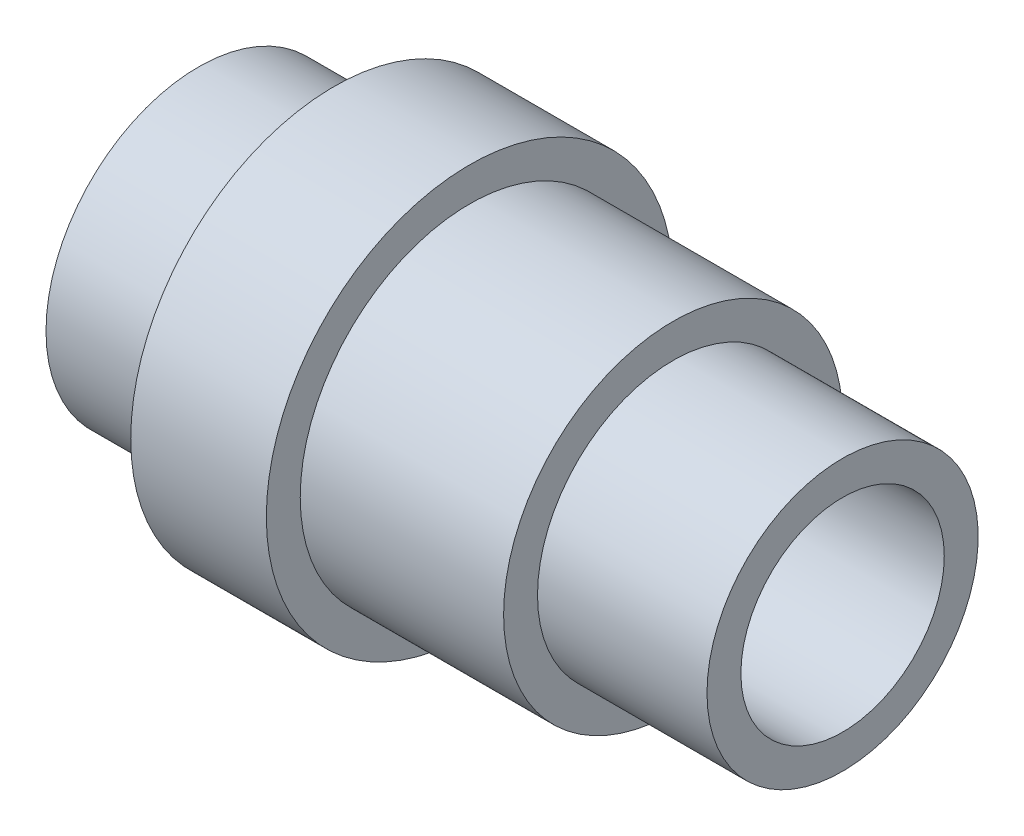
ISO-10303-21;
HEADER;
FILE_DESCRIPTION(('STEP AP214'),'2;1');
FILE_NAME('part.step','',(''),(''),'','','');
FILE_SCHEMA(('AUTOMOTIVE_DESIGN { 1 0 10303 214 1 1 1 1 }'));
ENDSEC;
DATA;
#1=APPLICATION_CONTEXT('core data for automotive mechanical design processes');
#2=APPLICATION_PROTOCOL_DEFINITION('international standard','automotive_design',2000,#1);
#3=PRODUCT_CONTEXT('',#1,'mechanical');
#4=PRODUCT('Part','Part','',(#3));
#5=PRODUCT_RELATED_PRODUCT_CATEGORY('part','',(#4));
#6=PRODUCT_DEFINITION_FORMATION('','',#4);
#7=PRODUCT_DEFINITION_CONTEXT('part definition',#1,'design');
#8=PRODUCT_DEFINITION('design','',#6,#7);
#9=PRODUCT_DEFINITION_SHAPE('','',#8);
#10=(LENGTH_UNIT() NAMED_UNIT(*) SI_UNIT(.MILLI.,.METRE.));
#11=(NAMED_UNIT(*) PLANE_ANGLE_UNIT() SI_UNIT($,.RADIAN.));
#12=(NAMED_UNIT(*) SI_UNIT($,.STERADIAN.) SOLID_ANGLE_UNIT());
#13=UNCERTAINTY_MEASURE_WITH_UNIT(LENGTH_MEASURE(1.E-05),#10,'distance_accuracy_value','');
#14=(GEOMETRIC_REPRESENTATION_CONTEXT(3) GLOBAL_UNCERTAINTY_ASSIGNED_CONTEXT((#13)) GLOBAL_UNIT_ASSIGNED_CONTEXT((#10,
#11,#12)) REPRESENTATION_CONTEXT('',''));
#15=CARTESIAN_POINT('',(0.,0.,0.));
#16=DIRECTION('',(0.,0.,1.));
#17=DIRECTION('',(1.,0.,0.));
#18=AXIS2_PLACEMENT_3D('',#15,#16,#17);
#19=CARTESIAN_POINT('',(-25.9538784067086,0.,0.));
#20=DIRECTION('',(-1.,0.,0.));
#21=DIRECTION('',(0.,0.,1.));
#22=AXIS2_PLACEMENT_3D('',#19,#20,#21);
#23=CYLINDRICAL_SURFACE('',#22,15.);
#24=CARTESIAN_POINT('',(47.5,0.,0.));
#25=DIRECTION('',(-1.,0.,0.));
#26=DIRECTION('',(0.,0.,1.));
#27=AXIS2_PLACEMENT_3D('',#24,#25,#26);
#28=CIRCLE('',#27,15.);
#29=CARTESIAN_POINT('',(47.5,0.,15.));
#30=VERTEX_POINT('',#29);
#31=EDGE_CURVE('E10',#30,#30,#28,.T.);
#32=ORIENTED_EDGE('',*,*,#31,.F.);
#33=EDGE_LOOP('',(#32));
#34=FACE_BOUND('',#33,.T.);
#35=CARTESIAN_POINT('',(-47.5,0.,0.));
#36=DIRECTION('',(-1.,0.,0.));
#37=DIRECTION('',(0.,0.,1.));
#38=AXIS2_PLACEMENT_3D('',#35,#36,#37);
#39=CIRCLE('',#38,15.);
#40=CARTESIAN_POINT('',(-47.5,0.,15.));
#41=VERTEX_POINT('',#40);
#42=EDGE_CURVE('E80',#41,#41,#39,.T.);
#43=ORIENTED_EDGE('',*,*,#42,.T.);
#44=EDGE_LOOP('',(#43));
#45=FACE_BOUND('',#44,.T.);
#46=ADVANCED_FACE('F37',(#34,#45),#23,.F.);
#47=CARTESIAN_POINT('',(47.5,15.,0.));
#48=DIRECTION('',(-1.,0.,0.));
#49=DIRECTION('',(0.,0.,1.));
#50=AXIS2_PLACEMENT_3D('',#47,#48,#49);
#51=PLANE('',#50);
#52=CARTESIAN_POINT('',(47.5,0.,0.));
#53=DIRECTION('',(-1.,0.,0.));
#54=DIRECTION('',(0.,0.,1.));
#55=AXIS2_PLACEMENT_3D('',#52,#53,#54);
#56=CIRCLE('',#55,20.);
#57=CARTESIAN_POINT('',(47.5,0.,20.));
#58=VERTEX_POINT('',#57);
#59=EDGE_CURVE('E44',#58,#58,#56,.T.);
#60=ORIENTED_EDGE('',*,*,#59,.F.);
#61=EDGE_LOOP('',(#60));
#62=FACE_BOUND('',#61,.T.);
#63=ORIENTED_EDGE('',*,*,#31,.T.);
#64=EDGE_LOOP('',(#63));
#65=FACE_BOUND('',#64,.T.);
#66=ADVANCED_FACE('F130',(#62,#65),#51,.F.);
#67=CARTESIAN_POINT('',(-25.9538784067086,0.,0.));
#68=DIRECTION('',(-1.,0.,0.));
#69=DIRECTION('',(0.,0.,1.));
#70=AXIS2_PLACEMENT_3D('',#67,#68,#69);
#71=CYLINDRICAL_SURFACE('',#70,20.);
#72=CARTESIAN_POINT('',(22.5,0.,0.));
#73=DIRECTION('',(-1.,0.,0.));
#74=DIRECTION('',(0.,0.,1.));
#75=AXIS2_PLACEMENT_3D('',#72,#73,#74);
#76=CIRCLE('',#75,20.);
#77=CARTESIAN_POINT('',(22.5,0.,20.));
#78=VERTEX_POINT('',#77);
#79=EDGE_CURVE('E49',#78,#78,#76,.T.);
#80=ORIENTED_EDGE('',*,*,#79,.F.);
#81=EDGE_LOOP('',(#80));
#82=FACE_BOUND('',#81,.T.);
#83=ORIENTED_EDGE('',*,*,#59,.T.);
#84=EDGE_LOOP('',(#83));
#85=FACE_BOUND('',#84,.T.);
#86=ADVANCED_FACE('F125',(#82,#85),#71,.T.);
#87=CARTESIAN_POINT('',(22.5,20.,0.));
#88=DIRECTION('',(-1.,0.,0.));
#89=DIRECTION('',(0.,0.,1.));
#90=AXIS2_PLACEMENT_3D('',#87,#88,#89);
#91=PLANE('',#90);
#92=CARTESIAN_POINT('',(22.5,0.,0.));
#93=DIRECTION('',(-1.,0.,0.));
#94=DIRECTION('',(0.,0.,1.));
#95=AXIS2_PLACEMENT_3D('',#92,#93,#94);
#96=CIRCLE('',#95,25.);
#97=CARTESIAN_POINT('',(22.5,0.,25.));
#98=VERTEX_POINT('',#97);
#99=EDGE_CURVE('E54',#98,#98,#96,.T.);
#100=ORIENTED_EDGE('',*,*,#99,.F.);
#101=EDGE_LOOP('',(#100));
#102=FACE_BOUND('',#101,.T.);
#103=ORIENTED_EDGE('',*,*,#79,.T.);
#104=EDGE_LOOP('',(#103));
#105=FACE_BOUND('',#104,.T.);
#106=ADVANCED_FACE('F119',(#102,#105),#91,.F.);
#107=CARTESIAN_POINT('',(-25.9538784067086,0.,0.));
#108=DIRECTION('',(-1.,0.,0.));
#109=DIRECTION('',(0.,0.,1.));
#110=AXIS2_PLACEMENT_3D('',#107,#108,#109);
#111=CYLINDRICAL_SURFACE('',#110,25.);
#112=CARTESIAN_POINT('',(-7.5,0.,0.));
#113=DIRECTION('',(-1.,0.,0.));
#114=DIRECTION('',(0.,0.,1.));
#115=AXIS2_PLACEMENT_3D('',#112,#113,#114);
#116=CIRCLE('',#115,25.);
#117=CARTESIAN_POINT('',(-7.5,0.,25.));
#118=VERTEX_POINT('',#117);
#119=EDGE_CURVE('E60',#118,#118,#116,.T.);
#120=ORIENTED_EDGE('',*,*,#119,.F.);
#121=EDGE_LOOP('',(#120));
#122=FACE_BOUND('',#121,.T.);
#123=ORIENTED_EDGE('',*,*,#99,.T.);
#124=EDGE_LOOP('',(#123));
#125=FACE_BOUND('',#124,.T.);
#126=ADVANCED_FACE('F113',(#122,#125),#111,.T.);
#127=CARTESIAN_POINT('',(-7.5,25.,0.));
#128=DIRECTION('',(-1.,0.,0.));
#129=DIRECTION('',(0.,0.,1.));
#130=AXIS2_PLACEMENT_3D('',#127,#128,#129);
#131=PLANE('',#130);
#132=CARTESIAN_POINT('',(-7.5,0.,0.));
#133=DIRECTION('',(-1.,0.,0.));
#134=DIRECTION('',(0.,0.,1.));
#135=AXIS2_PLACEMENT_3D('',#132,#133,#134);
#136=CIRCLE('',#135,30.);
#137=CARTESIAN_POINT('',(-7.5,0.,30.));
#138=VERTEX_POINT('',#137);
#139=EDGE_CURVE('E64',#138,#138,#136,.T.);
#140=ORIENTED_EDGE('',*,*,#139,.F.);
#141=EDGE_LOOP('',(#140));
#142=FACE_BOUND('',#141,.T.);
#143=ORIENTED_EDGE('',*,*,#119,.T.);
#144=EDGE_LOOP('',(#143));
#145=FACE_BOUND('',#144,.T.);
#146=ADVANCED_FACE('F107',(#142,#145),#131,.F.);
#147=CARTESIAN_POINT('',(-25.9538784067086,0.,0.));
#148=DIRECTION('',(-1.,0.,0.));
#149=DIRECTION('',(0.,0.,1.));
#150=AXIS2_PLACEMENT_3D('',#147,#148,#149);
#151=CYLINDRICAL_SURFACE('',#150,30.);
#152=CARTESIAN_POINT('',(-27.5,0.,0.));
#153=DIRECTION('',(-1.,0.,0.));
#154=DIRECTION('',(0.,0.,1.));
#155=AXIS2_PLACEMENT_3D('',#152,#153,#154);
#156=CIRCLE('',#155,30.);
#157=CARTESIAN_POINT('',(-27.5,0.,30.));
#158=VERTEX_POINT('',#157);
#159=EDGE_CURVE('E68',#158,#158,#156,.T.);
#160=ORIENTED_EDGE('',*,*,#159,.F.);
#161=EDGE_LOOP('',(#160));
#162=FACE_BOUND('',#161,.T.);
#163=ORIENTED_EDGE('',*,*,#139,.T.);
#164=EDGE_LOOP('',(#163));
#165=FACE_BOUND('',#164,.T.);
#166=ADVANCED_FACE('F101',(#162,#165),#151,.T.);
#167=CARTESIAN_POINT('',(-27.5,30.,0.));
#168=DIRECTION('',(1.,0.,0.));
#169=DIRECTION('',(0.,0.,-1.));
#170=AXIS2_PLACEMENT_3D('',#167,#168,#169);
#171=PLANE('',#170);
#172=CARTESIAN_POINT('',(-27.5,0.,0.));
#173=DIRECTION('',(-1.,0.,0.));
#174=DIRECTION('',(0.,0.,1.));
#175=AXIS2_PLACEMENT_3D('',#172,#173,#174);
#176=CIRCLE('',#175,22.5);
#177=CARTESIAN_POINT('',(-27.5,0.,22.5));
#178=VERTEX_POINT('',#177);
#179=EDGE_CURVE('E72',#178,#178,#176,.T.);
#180=ORIENTED_EDGE('',*,*,#179,.F.);
#181=EDGE_LOOP('',(#180));
#182=FACE_BOUND('',#181,.T.);
#183=ORIENTED_EDGE('',*,*,#159,.T.);
#184=EDGE_LOOP('',(#183));
#185=FACE_BOUND('',#184,.T.);
#186=ADVANCED_FACE('F95',(#182,#185),#171,.F.);
#187=CARTESIAN_POINT('',(-25.9538784067086,0.,0.));
#188=DIRECTION('',(-1.,0.,0.));
#189=DIRECTION('',(0.,0.,1.));
#190=AXIS2_PLACEMENT_3D('',#187,#188,#189);
#191=CYLINDRICAL_SURFACE('',#190,22.5);
#192=CARTESIAN_POINT('',(-47.5,0.,0.));
#193=DIRECTION('',(-1.,0.,0.));
#194=DIRECTION('',(0.,0.,1.));
#195=AXIS2_PLACEMENT_3D('',#192,#193,#194);
#196=CIRCLE('',#195,22.5);
#197=CARTESIAN_POINT('',(-47.5,0.,22.5));
#198=VERTEX_POINT('',#197);
#199=EDGE_CURVE('E76',#198,#198,#196,.T.);
#200=ORIENTED_EDGE('',*,*,#199,.F.);
#201=EDGE_LOOP('',(#200));
#202=FACE_BOUND('',#201,.T.);
#203=ORIENTED_EDGE('',*,*,#179,.T.);
#204=EDGE_LOOP('',(#203));
#205=FACE_BOUND('',#204,.T.);
#206=ADVANCED_FACE('F89',(#202,#205),#191,.T.);
#207=CARTESIAN_POINT('',(-47.5,22.5,0.));
#208=DIRECTION('',(1.,0.,0.));
#209=DIRECTION('',(0.,0.,-1.));
#210=AXIS2_PLACEMENT_3D('',#207,#208,#209);
#211=PLANE('',#210);
#212=ORIENTED_EDGE('',*,*,#42,.F.);
#213=EDGE_LOOP('',(#212));
#214=FACE_BOUND('',#213,.T.);
#215=ORIENTED_EDGE('',*,*,#199,.T.);
#216=EDGE_LOOP('',(#215));
#217=FACE_BOUND('',#216,.T.);
#218=ADVANCED_FACE('F86',(#214,#217),#211,.F.);
#219=CLOSED_SHELL('',(#46,#66,#86,#106,#126,#146,#166,#186,#206,#218));
#220=MANIFOLD_SOLID_BREP('B2',#219);
#221=ADVANCED_BREP_SHAPE_REPRESENTATION('',(#18,#220),#14);
#222=SHAPE_DEFINITION_REPRESENTATION(#9,#221);
ENDSEC;
END-ISO-10303-21;
